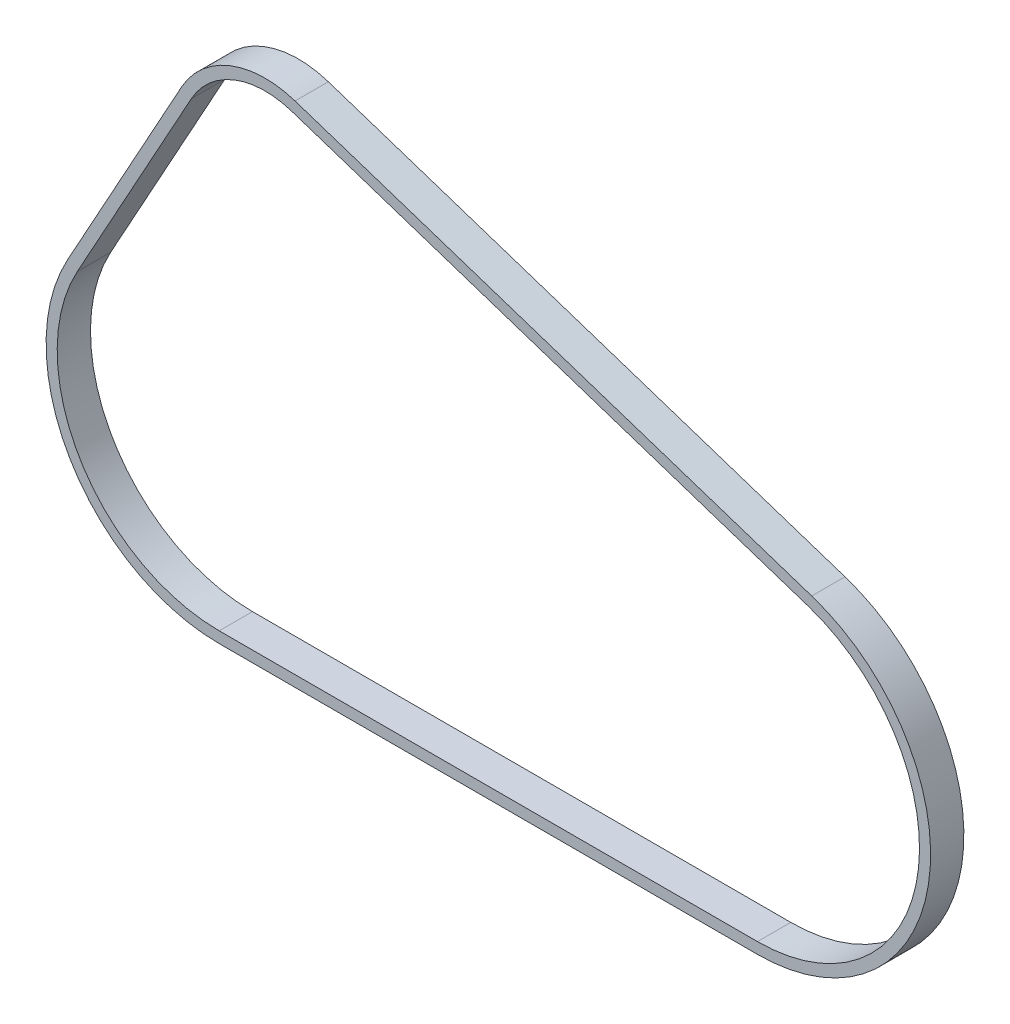
ISO-10303-21;
HEADER;
FILE_DESCRIPTION(('STEP AP214'),'2;1');
FILE_NAME('part.step','',(''),(''),'','','');
FILE_SCHEMA(('AUTOMOTIVE_DESIGN { 1 0 10303 214 1 1 1 1 }'));
ENDSEC;
DATA;
#1=APPLICATION_CONTEXT('core data for automotive mechanical design processes');
#2=APPLICATION_PROTOCOL_DEFINITION('international standard','automotive_design',2000,#1);
#3=PRODUCT_CONTEXT('',#1,'mechanical');
#4=PRODUCT('Part','Part','',(#3));
#5=PRODUCT_RELATED_PRODUCT_CATEGORY('part','',(#4));
#6=PRODUCT_DEFINITION_FORMATION('','',#4);
#7=PRODUCT_DEFINITION_CONTEXT('part definition',#1,'design');
#8=PRODUCT_DEFINITION('design','',#6,#7);
#9=PRODUCT_DEFINITION_SHAPE('','',#8);
#10=(LENGTH_UNIT() NAMED_UNIT(*) SI_UNIT(.MILLI.,.METRE.));
#11=(NAMED_UNIT(*) PLANE_ANGLE_UNIT() SI_UNIT($,.RADIAN.));
#12=(NAMED_UNIT(*) SI_UNIT($,.STERADIAN.) SOLID_ANGLE_UNIT());
#13=UNCERTAINTY_MEASURE_WITH_UNIT(LENGTH_MEASURE(1.E-05),#10,'distance_accuracy_value','');
#14=(GEOMETRIC_REPRESENTATION_CONTEXT(3) GLOBAL_UNCERTAINTY_ASSIGNED_CONTEXT((#13)) GLOBAL_UNIT_ASSIGNED_CONTEXT((#10,
#11,#12)) REPRESENTATION_CONTEXT('',''));
#15=CARTESIAN_POINT('',(0.,0.,0.));
#16=DIRECTION('',(0.,0.,1.));
#17=DIRECTION('',(1.,0.,0.));
#18=AXIS2_PLACEMENT_3D('',#15,#16,#17);
#19=CARTESIAN_POINT('',(0.,0.,-7.5));
#20=DIRECTION('',(0.,0.,1.));
#21=DIRECTION('',(1.,0.,0.));
#22=AXIS2_PLACEMENT_3D('',#19,#20,#21);
#23=CYLINDRICAL_SURFACE('',#22,43.);
#24=DIRECTION('',(0.,0.,1.));
#25=VECTOR('',#24,1.);
#26=CARTESIAN_POINT('',(-37.6499987601527,20.7720387386627,-7.5));
#27=LINE('',#26,#25);
#28=CARTESIAN_POINT('',(-37.6499987601527,20.7720387386627,-7.5));
#29=VERTEX_POINT('',#28);
#30=CARTESIAN_POINT('',(-37.6499987601527,20.7720387386627,7.5));
#31=VERTEX_POINT('',#30);
#32=EDGE_CURVE('E112',#29,#31,#27,.T.);
#33=ORIENTED_EDGE('',*,*,#32,.T.);
#34=CARTESIAN_POINT('',(0.,0.,7.5));
#35=DIRECTION('',(0.,0.,1.));
#36=DIRECTION('',(1.,0.,0.));
#37=AXIS2_PLACEMENT_3D('',#34,#35,#36);
#38=CIRCLE('',#37,43.);
#39=CARTESIAN_POINT('',(13.4662432517095,40.8369966168643,7.49999999999999));
#40=VERTEX_POINT('',#39);
#41=EDGE_CURVE('E235',#40,#31,#38,.T.);
#42=ORIENTED_EDGE('',*,*,#41,.F.);
#43=DIRECTION('',(0.,0.,1.));
#44=VECTOR('',#43,1.);
#45=CARTESIAN_POINT('',(13.4662432517095,40.8369966168643,-7.50000000000001));
#46=LINE('',#45,#44);
#47=CARTESIAN_POINT('',(13.4662432517095,40.8369966168643,-7.50000000000001));
#48=VERTEX_POINT('',#47);
#49=EDGE_CURVE('E12',#48,#40,#46,.T.);
#50=ORIENTED_EDGE('',*,*,#49,.F.);
#51=CARTESIAN_POINT('',(0.,0.,-7.5));
#52=DIRECTION('',(0.,0.,1.));
#53=DIRECTION('',(1.,0.,0.));
#54=AXIS2_PLACEMENT_3D('',#51,#52,#53);
#55=CIRCLE('',#54,43.);
#56=EDGE_CURVE('E266',#48,#29,#55,.T.);
#57=ORIENTED_EDGE('',*,*,#56,.T.);
#58=EDGE_LOOP('',(#33,#42,#50,#57));
#59=FACE_BOUND('',#58,.T.);
#60=ADVANCED_FACE('F109',(#59),#23,.T.);
#61=CARTESIAN_POINT('',(246.246214369928,-35.9235875321996,-7.5));
#62=DIRECTION('',(0.313168447714176,0.94969759574103,0.));
#63=DIRECTION('',(-0.949697595741031,0.313168447714176,0.));
#64=AXIS2_PLACEMENT_3D('',#61,#62,#63);
#65=PLANE('',#64);
#66=ORIENTED_EDGE('',*,*,#49,.T.);
#67=DIRECTION('',(-0.949697595741031,0.313168447714176,0.));
#68=VECTOR('',#67,1.);
#69=CARTESIAN_POINT('',(246.246214369928,-35.9235875321996,7.5));
#70=LINE('',#69,#68);
#71=CARTESIAN_POINT('',(246.246214369928,-35.9235875321996,7.5));
#72=VERTEX_POINT('',#71);
#73=EDGE_CURVE('E250',#72,#40,#70,.T.);
#74=ORIENTED_EDGE('',*,*,#73,.F.);
#75=DIRECTION('',(0.,0.,1.));
#76=VECTOR('',#75,1.);
#77=CARTESIAN_POINT('',(246.246214369928,-35.9235875321996,-7.5));
#78=LINE('',#77,#76);
#79=CARTESIAN_POINT('',(246.246214369928,-35.9235875321996,-7.5));
#80=VERTEX_POINT('',#79);
#81=EDGE_CURVE('E117',#80,#72,#78,.T.);
#82=ORIENTED_EDGE('',*,*,#81,.F.);
#83=DIRECTION('',(-0.949697595741031,0.313168447714176,0.));
#84=VECTOR('',#83,1.);
#85=CARTESIAN_POINT('',(246.246214369928,-35.9235875321996,-7.5));
#86=LINE('',#85,#84);
#87=EDGE_CURVE('E287',#80,#48,#86,.T.);
#88=ORIENTED_EDGE('',*,*,#87,.T.);
#89=EDGE_LOOP('',(#66,#74,#82,#88));
#90=FACE_BOUND('',#89,.T.);
#91=ADVANCED_FACE('F304',(#90),#65,.T.);
#92=CARTESIAN_POINT('',(221.819075448222,-110.,-7.5));
#93=DIRECTION('',(0.,0.,1.));
#94=DIRECTION('',(1.,0.,0.));
#95=AXIS2_PLACEMENT_3D('',#92,#93,#94);
#96=CYLINDRICAL_SURFACE('',#95,78.);
#97=ORIENTED_EDGE('',*,*,#81,.T.);
#98=CARTESIAN_POINT('',(221.819075448222,-110.,7.5));
#99=DIRECTION('',(0.,0.,1.));
#100=DIRECTION('',(1.,0.,0.));
#101=AXIS2_PLACEMENT_3D('',#98,#99,#100);
#102=CIRCLE('',#101,78.);
#103=CARTESIAN_POINT('',(221.819075448222,-188.,7.5));
#104=VERTEX_POINT('',#103);
#105=EDGE_CURVE('E247',#104,#72,#102,.T.);
#106=ORIENTED_EDGE('',*,*,#105,.F.);
#107=DIRECTION('',(0.,0.,1.));
#108=VECTOR('',#107,1.);
#109=CARTESIAN_POINT('',(221.819075448222,-188.,-7.5));
#110=LINE('',#109,#108);
#111=CARTESIAN_POINT('',(221.819075448222,-188.,-7.5));
#112=VERTEX_POINT('',#111);
#113=EDGE_CURVE('E291',#112,#104,#110,.T.);
#114=ORIENTED_EDGE('',*,*,#113,.F.);
#115=CARTESIAN_POINT('',(221.819075448222,-110.,-7.5));
#116=DIRECTION('',(0.,0.,1.));
#117=DIRECTION('',(1.,0.,0.));
#118=AXIS2_PLACEMENT_3D('',#115,#116,#117);
#119=CIRCLE('',#118,78.);
#120=EDGE_CURVE('E284',#112,#80,#119,.T.);
#121=ORIENTED_EDGE('',*,*,#120,.T.);
#122=EDGE_LOOP('',(#97,#106,#114,#121));
#123=FACE_BOUND('',#122,.T.);
#124=ADVANCED_FACE('F317',(#123),#96,.T.);
#125=CARTESIAN_POINT('',(-20.7151205029609,-188.,-7.5));
#126=DIRECTION('',(0.,-1.,0.));
#127=DIRECTION('',(0.,0.,-1.));
#128=AXIS2_PLACEMENT_3D('',#125,#126,#127);
#129=PLANE('',#128);
#130=ORIENTED_EDGE('',*,*,#113,.T.);
#131=DIRECTION('',(1.,0.,0.));
#132=VECTOR('',#131,1.);
#133=CARTESIAN_POINT('',(-20.7151205029609,-188.,7.5));
#134=LINE('',#133,#132);
#135=CARTESIAN_POINT('',(-20.7151205029609,-188.,7.5));
#136=VERTEX_POINT('',#135);
#137=EDGE_CURVE('E244',#136,#104,#134,.T.);
#138=ORIENTED_EDGE('',*,*,#137,.F.);
#139=DIRECTION('',(0.,0.,1.));
#140=VECTOR('',#139,1.);
#141=CARTESIAN_POINT('',(-20.7151205029609,-188.,-7.5));
#142=LINE('',#141,#140);
#143=CARTESIAN_POINT('',(-20.7151205029609,-188.,-7.5));
#144=VERTEX_POINT('',#143);
#145=EDGE_CURVE('E293',#144,#136,#142,.T.);
#146=ORIENTED_EDGE('',*,*,#145,.F.);
#147=DIRECTION('',(1.,0.,0.));
#148=VECTOR('',#147,1.);
#149=CARTESIAN_POINT('',(-20.7151205029609,-188.,-7.5));
#150=LINE('',#149,#148);
#151=EDGE_CURVE('E281',#144,#112,#150,.T.);
#152=ORIENTED_EDGE('',*,*,#151,.T.);
#153=EDGE_LOOP('',(#130,#138,#146,#152));
#154=FACE_BOUND('',#153,.T.);
#155=ADVANCED_FACE('F315',(#154),#129,.T.);
#156=CARTESIAN_POINT('',(-20.7151205029609,-110.,-7.5));
#157=DIRECTION('',(0.,0.,1.));
#158=DIRECTION('',(1.,0.,0.));
#159=AXIS2_PLACEMENT_3D('',#156,#157,#158);
#160=CYLINDRICAL_SURFACE('',#159,78.);
#161=ORIENTED_EDGE('',*,*,#145,.T.);
#162=CARTESIAN_POINT('',(-20.7151205029609,-110.,7.5));
#163=DIRECTION('',(0.,0.,1.));
#164=DIRECTION('',(1.,0.,0.));
#165=AXIS2_PLACEMENT_3D('',#162,#163,#164);
#166=CIRCLE('',#165,78.);
#167=CARTESIAN_POINT('',(-89.0104670911448,-72.3204878694026,7.5));
#168=VERTEX_POINT('',#167);
#169=EDGE_CURVE('E241',#168,#136,#166,.T.);
#170=ORIENTED_EDGE('',*,*,#169,.F.);
#171=DIRECTION('',(0.,0.,1.));
#172=VECTOR('',#171,1.);
#173=CARTESIAN_POINT('',(-89.0104670911448,-72.3204878694026,-7.5));
#174=LINE('',#173,#172);
#175=CARTESIAN_POINT('',(-89.0104670911448,-72.3204878694026,-7.5));
#176=VERTEX_POINT('',#175);
#177=EDGE_CURVE('E294',#176,#168,#174,.T.);
#178=ORIENTED_EDGE('',*,*,#177,.F.);
#179=CARTESIAN_POINT('',(-20.7151205029609,-110.,-7.5));
#180=DIRECTION('',(0.,0.,1.));
#181=DIRECTION('',(1.,0.,0.));
#182=AXIS2_PLACEMENT_3D('',#179,#180,#181);
#183=CIRCLE('',#182,78.);
#184=EDGE_CURVE('E278',#176,#144,#183,.T.);
#185=ORIENTED_EDGE('',*,*,#184,.T.);
#186=EDGE_LOOP('',(#161,#170,#178,#185));
#187=FACE_BOUND('',#186,.T.);
#188=ADVANCED_FACE('F312',(#187),#160,.T.);
#189=CARTESIAN_POINT('',(-37.6499987601527,20.7720387386627,-7.5));
#190=DIRECTION('',(-0.875581366515178,0.483070668340992,0.));
#191=DIRECTION('',(-0.483070668340992,-0.875581366515178,0.));
#192=AXIS2_PLACEMENT_3D('',#189,#190,#191);
#193=PLANE('',#192);
#194=ORIENTED_EDGE('',*,*,#177,.T.);
#195=DIRECTION('',(-0.483070668340992,-0.875581366515178,0.));
#196=VECTOR('',#195,1.);
#197=CARTESIAN_POINT('',(-37.6499987601527,20.7720387386627,7.5));
#198=LINE('',#197,#196);
#199=EDGE_CURVE('E238',#31,#168,#198,.T.);
#200=ORIENTED_EDGE('',*,*,#199,.F.);
#201=ORIENTED_EDGE('',*,*,#32,.F.);
#202=DIRECTION('',(-0.483070668340992,-0.875581366515178,0.));
#203=VECTOR('',#202,1.);
#204=CARTESIAN_POINT('',(-37.6499987601527,20.7720387386627,-7.5));
#205=LINE('',#204,#203);
#206=EDGE_CURVE('E275',#29,#176,#205,.T.);
#207=ORIENTED_EDGE('',*,*,#206,.T.);
#208=EDGE_LOOP('',(#194,#200,#201,#207));
#209=FACE_BOUND('',#208,.T.);
#210=ADVANCED_FACE('F298',(#209),#193,.T.);
#211=CARTESIAN_POINT('',(0.,0.,-7.5));
#212=DIRECTION('',(0.,0.,1.));
#213=DIRECTION('',(1.,0.,0.));
#214=AXIS2_PLACEMENT_3D('',#211,#212,#213);
#215=PLANE('',#214);
#216=DIRECTION('',(-0.949697595741031,0.313168447714176,0.));
#217=VECTOR('',#216,1.);
#218=CARTESIAN_POINT('',(244.680372131357,-40.6720755109047,-7.5));
#219=LINE('',#218,#217);
#220=CARTESIAN_POINT('',(244.680372131357,-40.6720755109047,-7.5));
#221=VERTEX_POINT('',#220);
#222=CARTESIAN_POINT('',(11.9004010131387,36.0885086381592,-7.5));
#223=VERTEX_POINT('',#222);
#224=EDGE_CURVE('E210',#221,#223,#219,.T.);
#225=ORIENTED_EDGE('',*,*,#224,.T.);
#226=CARTESIAN_POINT('',(0.,0.,-7.5));
#227=DIRECTION('',(0.,0.,1.));
#228=DIRECTION('',(1.,0.,0.));
#229=AXIS2_PLACEMENT_3D('',#226,#227,#228);
#230=CIRCLE('',#229,38.);
#231=CARTESIAN_POINT('',(-33.2720919275768,18.3566853969577,-7.5));
#232=VERTEX_POINT('',#231);
#233=EDGE_CURVE('E253',#223,#232,#230,.T.);
#234=ORIENTED_EDGE('',*,*,#233,.T.);
#235=DIRECTION('',(-0.483070668340992,-0.875581366515178,0.));
#236=VECTOR('',#235,1.);
#237=CARTESIAN_POINT('',(-33.2720919275768,18.3566853969577,-7.5));
#238=LINE('',#237,#236);
#239=CARTESIAN_POINT('',(-84.632560258569,-74.7358412111075,-7.5));
#240=VERTEX_POINT('',#239);
#241=EDGE_CURVE('E205',#232,#240,#238,.T.);
#242=ORIENTED_EDGE('',*,*,#241,.T.);
#243=CARTESIAN_POINT('',(-20.7151205029609,-110.,-7.5));
#244=DIRECTION('',(0.,0.,1.));
#245=DIRECTION('',(1.,0.,0.));
#246=AXIS2_PLACEMENT_3D('',#243,#244,#245);
#247=CIRCLE('',#246,73.);
#248=CARTESIAN_POINT('',(-20.7151205029609,-183.,-7.5));
#249=VERTEX_POINT('',#248);
#250=EDGE_CURVE('E125',#240,#249,#247,.T.);
#251=ORIENTED_EDGE('',*,*,#250,.T.);
#252=DIRECTION('',(1.,0.,0.));
#253=VECTOR('',#252,1.);
#254=CARTESIAN_POINT('',(-20.7151205029609,-183.,-7.5));
#255=LINE('',#254,#253);
#256=CARTESIAN_POINT('',(221.819075448222,-183.,-7.5));
#257=VERTEX_POINT('',#256);
#258=EDGE_CURVE('E257',#249,#257,#255,.T.);
#259=ORIENTED_EDGE('',*,*,#258,.T.);
#260=CARTESIAN_POINT('',(221.819075448222,-110.,-7.5));
#261=DIRECTION('',(0.,0.,1.));
#262=DIRECTION('',(1.,0.,0.));
#263=AXIS2_PLACEMENT_3D('',#260,#261,#262);
#264=CIRCLE('',#263,73.);
#265=EDGE_CURVE('E260',#257,#221,#264,.T.);
#266=ORIENTED_EDGE('',*,*,#265,.T.);
#267=EDGE_LOOP('',(#225,#234,#242,#251,#259,#266));
#268=FACE_BOUND('',#267,.T.);
#269=ORIENTED_EDGE('',*,*,#56,.F.);
#270=ORIENTED_EDGE('',*,*,#87,.F.);
#271=ORIENTED_EDGE('',*,*,#120,.F.);
#272=ORIENTED_EDGE('',*,*,#151,.F.);
#273=ORIENTED_EDGE('',*,*,#184,.F.);
#274=ORIENTED_EDGE('',*,*,#206,.F.);
#275=EDGE_LOOP('',(#269,#270,#271,#272,#273,#274));
#276=FACE_BOUND('',#275,.T.);
#277=ADVANCED_FACE('F308',(#268,#276),#215,.F.);
#278=CARTESIAN_POINT('',(0.,0.,-7.5));
#279=DIRECTION('',(0.,0.,1.));
#280=DIRECTION('',(1.,0.,0.));
#281=AXIS2_PLACEMENT_3D('',#278,#279,#280);
#282=CYLINDRICAL_SURFACE('',#281,38.);
#283=DIRECTION('',(0.,0.,1.));
#284=VECTOR('',#283,1.);
#285=CARTESIAN_POINT('',(11.9004010131387,36.0885086381592,-7.5));
#286=LINE('',#285,#284);
#287=CARTESIAN_POINT('',(11.9004010131387,36.0885086381592,7.5));
#288=VERTEX_POINT('',#287);
#289=EDGE_CURVE('E215',#223,#288,#286,.T.);
#290=ORIENTED_EDGE('',*,*,#289,.T.);
#291=CARTESIAN_POINT('',(0.,0.,7.5));
#292=DIRECTION('',(0.,0.,1.));
#293=DIRECTION('',(1.,0.,0.));
#294=AXIS2_PLACEMENT_3D('',#291,#292,#293);
#295=CIRCLE('',#294,38.);
#296=CARTESIAN_POINT('',(-33.2720919275768,18.3566853969577,7.5));
#297=VERTEX_POINT('',#296);
#298=EDGE_CURVE('E213',#288,#297,#295,.T.);
#299=ORIENTED_EDGE('',*,*,#298,.T.);
#300=DIRECTION('',(0.,0.,1.));
#301=VECTOR('',#300,1.);
#302=CARTESIAN_POINT('',(-33.2720919275768,18.3566853969577,-7.5));
#303=LINE('',#302,#301);
#304=EDGE_CURVE('E198',#232,#297,#303,.T.);
#305=ORIENTED_EDGE('',*,*,#304,.F.);
#306=ORIENTED_EDGE('',*,*,#233,.F.);
#307=EDGE_LOOP('',(#290,#299,#305,#306));
#308=FACE_BOUND('',#307,.T.);
#309=ADVANCED_FACE('F214',(#308),#282,.F.);
#310=CARTESIAN_POINT('',(244.680372131357,-40.6720755109047,-7.5));
#311=DIRECTION('',(0.313168447714176,0.94969759574103,0.));
#312=DIRECTION('',(-0.949697595741031,0.313168447714176,0.));
#313=AXIS2_PLACEMENT_3D('',#310,#311,#312);
#314=PLANE('',#313);
#315=DIRECTION('',(0.,0.,1.));
#316=VECTOR('',#315,1.);
#317=CARTESIAN_POINT('',(244.680372131357,-40.6720755109047,-7.5));
#318=LINE('',#317,#316);
#319=CARTESIAN_POINT('',(244.680372131357,-40.6720755109048,7.5));
#320=VERTEX_POINT('',#319);
#321=EDGE_CURVE('E267',#221,#320,#318,.T.);
#322=ORIENTED_EDGE('',*,*,#321,.T.);
#323=DIRECTION('',(-0.949697595741031,0.313168447714176,0.));
#324=VECTOR('',#323,1.);
#325=CARTESIAN_POINT('',(244.680372131357,-40.6720755109047,7.5));
#326=LINE('',#325,#324);
#327=EDGE_CURVE('E233',#320,#288,#326,.T.);
#328=ORIENTED_EDGE('',*,*,#327,.T.);
#329=ORIENTED_EDGE('',*,*,#289,.F.);
#330=ORIENTED_EDGE('',*,*,#224,.F.);
#331=EDGE_LOOP('',(#322,#328,#329,#330));
#332=FACE_BOUND('',#331,.T.);
#333=ADVANCED_FACE('F376',(#332),#314,.F.);
#334=CARTESIAN_POINT('',(221.819075448222,-110.,-7.5));
#335=DIRECTION('',(0.,0.,1.));
#336=DIRECTION('',(1.,0.,0.));
#337=AXIS2_PLACEMENT_3D('',#334,#335,#336);
#338=CYLINDRICAL_SURFACE('',#337,73.);
#339=DIRECTION('',(0.,0.,1.));
#340=VECTOR('',#339,1.);
#341=CARTESIAN_POINT('',(221.819075448222,-183.,-7.5));
#342=LINE('',#341,#340);
#343=CARTESIAN_POINT('',(221.819075448222,-183.,7.5));
#344=VERTEX_POINT('',#343);
#345=EDGE_CURVE('E269',#257,#344,#342,.T.);
#346=ORIENTED_EDGE('',*,*,#345,.T.);
#347=CARTESIAN_POINT('',(221.819075448222,-110.,7.5));
#348=DIRECTION('',(0.,0.,1.));
#349=DIRECTION('',(1.,0.,0.));
#350=AXIS2_PLACEMENT_3D('',#347,#348,#349);
#351=CIRCLE('',#350,73.);
#352=EDGE_CURVE('E230',#344,#320,#351,.T.);
#353=ORIENTED_EDGE('',*,*,#352,.T.);
#354=ORIENTED_EDGE('',*,*,#321,.F.);
#355=ORIENTED_EDGE('',*,*,#265,.F.);
#356=EDGE_LOOP('',(#346,#353,#354,#355));
#357=FACE_BOUND('',#356,.T.);
#358=ADVANCED_FACE('F385',(#357),#338,.F.);
#359=CARTESIAN_POINT('',(-20.7151205029609,-183.,-7.5));
#360=DIRECTION('',(0.,-1.,0.));
#361=DIRECTION('',(0.,0.,-1.));
#362=AXIS2_PLACEMENT_3D('',#359,#360,#361);
#363=PLANE('',#362);
#364=DIRECTION('',(0.,0.,1.));
#365=VECTOR('',#364,1.);
#366=CARTESIAN_POINT('',(-20.7151205029609,-183.,-7.5));
#367=LINE('',#366,#365);
#368=CARTESIAN_POINT('',(-20.7151205029609,-183.,7.5));
#369=VERTEX_POINT('',#368);
#370=EDGE_CURVE('E271',#249,#369,#367,.T.);
#371=ORIENTED_EDGE('',*,*,#370,.T.);
#372=DIRECTION('',(1.,0.,0.));
#373=VECTOR('',#372,1.);
#374=CARTESIAN_POINT('',(-20.7151205029609,-183.,7.5));
#375=LINE('',#374,#373);
#376=EDGE_CURVE('E225',#369,#344,#375,.T.);
#377=ORIENTED_EDGE('',*,*,#376,.T.);
#378=ORIENTED_EDGE('',*,*,#345,.F.);
#379=ORIENTED_EDGE('',*,*,#258,.F.);
#380=EDGE_LOOP('',(#371,#377,#378,#379));
#381=FACE_BOUND('',#380,.T.);
#382=ADVANCED_FACE('F395',(#381),#363,.F.);
#383=CARTESIAN_POINT('',(-20.7151205029609,-110.,-7.5));
#384=DIRECTION('',(0.,0.,1.));
#385=DIRECTION('',(1.,0.,0.));
#386=AXIS2_PLACEMENT_3D('',#383,#384,#385);
#387=CYLINDRICAL_SURFACE('',#386,73.);
#388=DIRECTION('',(0.,0.,1.));
#389=VECTOR('',#388,1.);
#390=CARTESIAN_POINT('',(-84.632560258569,-74.7358412111075,-7.5));
#391=LINE('',#390,#389);
#392=CARTESIAN_POINT('',(-84.632560258569,-74.7358412111075,7.5));
#393=VERTEX_POINT('',#392);
#394=EDGE_CURVE('E209',#240,#393,#391,.T.);
#395=ORIENTED_EDGE('',*,*,#394,.T.);
#396=CARTESIAN_POINT('',(-20.7151205029609,-110.,7.5));
#397=DIRECTION('',(0.,0.,1.));
#398=DIRECTION('',(1.,0.,0.));
#399=AXIS2_PLACEMENT_3D('',#396,#397,#398);
#400=CIRCLE('',#399,73.);
#401=EDGE_CURVE('E223',#393,#369,#400,.T.);
#402=ORIENTED_EDGE('',*,*,#401,.T.);
#403=ORIENTED_EDGE('',*,*,#370,.F.);
#404=ORIENTED_EDGE('',*,*,#250,.F.);
#405=EDGE_LOOP('',(#395,#402,#403,#404));
#406=FACE_BOUND('',#405,.T.);
#407=ADVANCED_FACE('F405',(#406),#387,.F.);
#408=CARTESIAN_POINT('',(-33.2720919275768,18.3566853969577,-7.5));
#409=DIRECTION('',(-0.875581366515178,0.483070668340992,0.));
#410=DIRECTION('',(-0.483070668340992,-0.875581366515178,0.));
#411=AXIS2_PLACEMENT_3D('',#408,#409,#410);
#412=PLANE('',#411);
#413=ORIENTED_EDGE('',*,*,#304,.T.);
#414=DIRECTION('',(-0.483070668340992,-0.875581366515178,0.));
#415=VECTOR('',#414,1.);
#416=CARTESIAN_POINT('',(-33.2720919275768,18.3566853969577,7.5));
#417=LINE('',#416,#415);
#418=EDGE_CURVE('E202',#297,#393,#417,.T.);
#419=ORIENTED_EDGE('',*,*,#418,.T.);
#420=ORIENTED_EDGE('',*,*,#394,.F.);
#421=ORIENTED_EDGE('',*,*,#241,.F.);
#422=EDGE_LOOP('',(#413,#419,#420,#421));
#423=FACE_BOUND('',#422,.T.);
#424=ADVANCED_FACE('F200',(#423),#412,.F.);
#425=CARTESIAN_POINT('',(0.,0.,7.5));
#426=DIRECTION('',(0.,0.,1.));
#427=DIRECTION('',(1.,0.,0.));
#428=AXIS2_PLACEMENT_3D('',#425,#426,#427);
#429=PLANE('',#428);
#430=ORIENTED_EDGE('',*,*,#41,.T.);
#431=ORIENTED_EDGE('',*,*,#199,.T.);
#432=ORIENTED_EDGE('',*,*,#169,.T.);
#433=ORIENTED_EDGE('',*,*,#137,.T.);
#434=ORIENTED_EDGE('',*,*,#105,.T.);
#435=ORIENTED_EDGE('',*,*,#73,.T.);
#436=EDGE_LOOP('',(#430,#431,#432,#433,#434,#435));
#437=FACE_BOUND('',#436,.T.);
#438=ORIENTED_EDGE('',*,*,#418,.F.);
#439=ORIENTED_EDGE('',*,*,#298,.F.);
#440=ORIENTED_EDGE('',*,*,#327,.F.);
#441=ORIENTED_EDGE('',*,*,#352,.F.);
#442=ORIENTED_EDGE('',*,*,#376,.F.);
#443=ORIENTED_EDGE('',*,*,#401,.F.);
#444=EDGE_LOOP('',(#438,#439,#440,#441,#442,#443));
#445=FACE_BOUND('',#444,.T.);
#446=ADVANCED_FACE('F220',(#437,#445),#429,.T.);
#447=CLOSED_SHELL('',(#60,#91,#124,#155,#188,#210,#277,#309,#333,#358,#382,#407,#424,#446));
#448=MANIFOLD_SOLID_BREP('B2',#447);
#449=ADVANCED_BREP_SHAPE_REPRESENTATION('',(#18,#448),#14);
#450=SHAPE_DEFINITION_REPRESENTATION(#9,#449);
ENDSEC;
END-ISO-10303-21;
